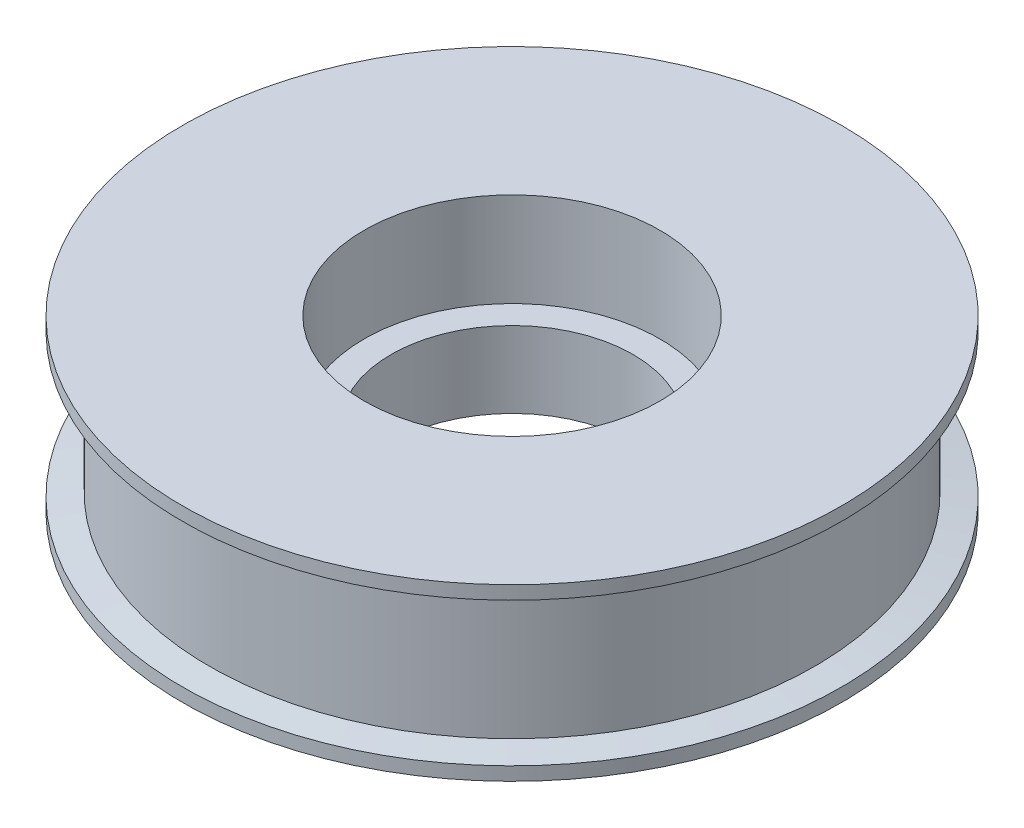
ISO-10303-21;
HEADER;
FILE_DESCRIPTION(('STEP AP214'),'2;1');
FILE_NAME('part.step','',(''),(''),'','','');
FILE_SCHEMA(('AUTOMOTIVE_DESIGN { 1 0 10303 214 1 1 1 1 }'));
ENDSEC;
DATA;
#1=APPLICATION_CONTEXT('core data for automotive mechanical design processes');
#2=APPLICATION_PROTOCOL_DEFINITION('international standard','automotive_design',2000,#1);
#3=PRODUCT_CONTEXT('',#1,'mechanical');
#4=PRODUCT('Part','Part','',(#3));
#5=PRODUCT_RELATED_PRODUCT_CATEGORY('part','',(#4));
#6=PRODUCT_DEFINITION_FORMATION('','',#4);
#7=PRODUCT_DEFINITION_CONTEXT('part definition',#1,'design');
#8=PRODUCT_DEFINITION('design','',#6,#7);
#9=PRODUCT_DEFINITION_SHAPE('','',#8);
#10=(LENGTH_UNIT() NAMED_UNIT(*) SI_UNIT(.MILLI.,.METRE.));
#11=(NAMED_UNIT(*) PLANE_ANGLE_UNIT() SI_UNIT($,.RADIAN.));
#12=(NAMED_UNIT(*) SI_UNIT($,.STERADIAN.) SOLID_ANGLE_UNIT());
#13=UNCERTAINTY_MEASURE_WITH_UNIT(LENGTH_MEASURE(1.E-05),#10,'distance_accuracy_value','');
#14=(GEOMETRIC_REPRESENTATION_CONTEXT(3) GLOBAL_UNCERTAINTY_ASSIGNED_CONTEXT((#13)) GLOBAL_UNIT_ASSIGNED_CONTEXT((#10,
#11,#12)) REPRESENTATION_CONTEXT('',''));
#15=CARTESIAN_POINT('',(0.,0.,0.));
#16=DIRECTION('',(0.,0.,1.));
#17=DIRECTION('',(1.,0.,0.));
#18=AXIS2_PLACEMENT_3D('',#15,#16,#17);
#19=CARTESIAN_POINT('',(0.,11.66,0.));
#20=DIRECTION('',(0.,1.,0.));
#21=DIRECTION('',(0.,0.,1.));
#22=AXIS2_PLACEMENT_3D('',#19,#20,#21);
#23=PLANE('',#22);
#24=CARTESIAN_POINT('',(0.,11.66,0.));
#25=DIRECTION('',(0.,1.,0.));
#26=DIRECTION('',(0.,0.,1.));
#27=AXIS2_PLACEMENT_3D('',#24,#25,#26);
#28=CIRCLE('',#27,11.);
#29=CARTESIAN_POINT('',(0.,11.66,11.));
#30=VERTEX_POINT('',#29);
#31=EDGE_CURVE('E40',#30,#30,#28,.T.);
#32=ORIENTED_EDGE('',*,*,#31,.F.);
#33=EDGE_LOOP('',(#32));
#34=FACE_BOUND('',#33,.T.);
#35=CARTESIAN_POINT('',(0.,11.66,0.));
#36=DIRECTION('',(0.,-1.,0.));
#37=DIRECTION('',(0.,0.,-1.));
#38=AXIS2_PLACEMENT_3D('',#35,#36,#37);
#39=CIRCLE('',#38,24.5);
#40=CARTESIAN_POINT('',(0.,11.66,-24.5));
#41=VERTEX_POINT('',#40);
#42=EDGE_CURVE('E53',#41,#41,#39,.T.);
#43=ORIENTED_EDGE('',*,*,#42,.F.);
#44=EDGE_LOOP('',(#43));
#45=FACE_BOUND('',#44,.T.);
#46=ADVANCED_FACE('F33',(#34,#45),#23,.T.);
#47=CARTESIAN_POINT('',(0.,11.66,0.));
#48=DIRECTION('',(0.,-1.,0.));
#49=DIRECTION('',(0.,0.,-1.));
#50=AXIS2_PLACEMENT_3D('',#47,#48,#49);
#51=CYLINDRICAL_SURFACE('',#50,22.5);
#52=CARTESIAN_POINT('',(0.,10.33,0.));
#53=DIRECTION('',(0.,-1.,0.));
#54=DIRECTION('',(0.,0.,-1.));
#55=AXIS2_PLACEMENT_3D('',#52,#53,#54);
#56=CIRCLE('',#55,22.5);
#57=CARTESIAN_POINT('',(0.,10.33,-22.5));
#58=VERTEX_POINT('',#57);
#59=EDGE_CURVE('E44',#58,#58,#56,.T.);
#60=ORIENTED_EDGE('',*,*,#59,.T.);
#61=EDGE_LOOP('',(#60));
#62=FACE_BOUND('',#61,.T.);
#63=CARTESIAN_POINT('',(0.,0.330000000000001,0.));
#64=DIRECTION('',(0.,-1.,0.));
#65=DIRECTION('',(0.,0.,-1.));
#66=AXIS2_PLACEMENT_3D('',#63,#64,#65);
#67=CIRCLE('',#66,22.5);
#68=CARTESIAN_POINT('',(0.,0.330000000000001,-22.5));
#69=VERTEX_POINT('',#68);
#70=EDGE_CURVE('E59',#69,#69,#67,.T.);
#71=ORIENTED_EDGE('',*,*,#70,.F.);
#72=EDGE_LOOP('',(#71));
#73=FACE_BOUND('',#72,.T.);
#74=ADVANCED_FACE('F35',(#62,#73),#51,.T.);
#75=CARTESIAN_POINT('',(0.,11.66,0.));
#76=DIRECTION('',(0.,-1.,0.));
#77=DIRECTION('',(0.,0.,-1.));
#78=AXIS2_PLACEMENT_3D('',#75,#76,#77);
#79=CYLINDRICAL_SURFACE('',#78,11.);
#80=CARTESIAN_POINT('',(0.,4.66,0.));
#81=DIRECTION('',(0.,1.,0.));
#82=DIRECTION('',(0.,0.,1.));
#83=AXIS2_PLACEMENT_3D('',#80,#81,#82);
#84=CIRCLE('',#83,11.);
#85=CARTESIAN_POINT('',(0.,4.66,11.));
#86=VERTEX_POINT('',#85);
#87=EDGE_CURVE('E10',#86,#86,#84,.T.);
#88=ORIENTED_EDGE('',*,*,#87,.F.);
#89=EDGE_LOOP('',(#88));
#90=FACE_BOUND('',#89,.T.);
#91=ORIENTED_EDGE('',*,*,#31,.T.);
#92=EDGE_LOOP('',(#91));
#93=FACE_BOUND('',#92,.T.);
#94=ADVANCED_FACE('F91',(#90,#93),#79,.F.);
#95=CARTESIAN_POINT('',(0.,10.33,0.));
#96=DIRECTION('',(0.,1.,0.));
#97=DIRECTION('',(0.,0.,1.));
#98=AXIS2_PLACEMENT_3D('',#95,#96,#97);
#99=CONICAL_SURFACE('',#98,22.5,1.4072697079739);
#100=CARTESIAN_POINT('',(0.,10.66,0.));
#101=DIRECTION('',(0.,-1.,0.));
#102=DIRECTION('',(0.,0.,-1.));
#103=AXIS2_PLACEMENT_3D('',#100,#101,#102);
#104=CIRCLE('',#103,24.5);
#105=CARTESIAN_POINT('',(0.,10.66,-24.5));
#106=VERTEX_POINT('',#105);
#107=EDGE_CURVE('E48',#106,#106,#104,.T.);
#108=ORIENTED_EDGE('',*,*,#107,.T.);
#109=EDGE_LOOP('',(#108));
#110=FACE_BOUND('',#109,.T.);
#111=ORIENTED_EDGE('',*,*,#59,.F.);
#112=EDGE_LOOP('',(#111));
#113=FACE_BOUND('',#112,.T.);
#114=ADVANCED_FACE('F97',(#110,#113),#99,.T.);
#115=CARTESIAN_POINT('',(0.,0.,0.));
#116=DIRECTION('',(0.,-1.,0.));
#117=DIRECTION('',(0.,0.,-1.));
#118=AXIS2_PLACEMENT_3D('',#115,#116,#117);
#119=CYLINDRICAL_SURFACE('',#118,24.5);
#120=ORIENTED_EDGE('',*,*,#42,.T.);
#121=EDGE_LOOP('',(#120));
#122=FACE_BOUND('',#121,.T.);
#123=ORIENTED_EDGE('',*,*,#107,.F.);
#124=EDGE_LOOP('',(#123));
#125=FACE_BOUND('',#124,.T.);
#126=ADVANCED_FACE('F101',(#122,#125),#119,.T.);
#127=CARTESIAN_POINT('',(22.5,4.66,0.));
#128=DIRECTION('',(0.,1.,0.));
#129=DIRECTION('',(0.,0.,1.));
#130=AXIS2_PLACEMENT_3D('',#127,#128,#129);
#131=PLANE('',#130);
#132=CARTESIAN_POINT('',(0.,4.66,0.));
#133=DIRECTION('',(0.,-1.,0.));
#134=DIRECTION('',(0.,0.,-1.));
#135=AXIS2_PLACEMENT_3D('',#132,#133,#134);
#136=CIRCLE('',#135,9.);
#137=CARTESIAN_POINT('',(0.,4.66,-9.));
#138=VERTEX_POINT('',#137);
#139=EDGE_CURVE('E56',#138,#138,#136,.T.);
#140=ORIENTED_EDGE('',*,*,#139,.T.);
#141=EDGE_LOOP('',(#140));
#142=FACE_BOUND('',#141,.T.);
#143=ORIENTED_EDGE('',*,*,#87,.T.);
#144=EDGE_LOOP('',(#143));
#145=FACE_BOUND('',#144,.T.);
#146=ADVANCED_FACE('F105',(#142,#145),#131,.T.);
#147=CARTESIAN_POINT('',(0.,0.,0.));
#148=DIRECTION('',(0.,-1.,0.));
#149=DIRECTION('',(0.,0.,-1.));
#150=AXIS2_PLACEMENT_3D('',#147,#148,#149);
#151=CYLINDRICAL_SURFACE('',#150,9.);
#152=CARTESIAN_POINT('',(0.,-0.999999999999999,0.));
#153=DIRECTION('',(0.,-1.,0.));
#154=DIRECTION('',(0.,0.,-1.));
#155=AXIS2_PLACEMENT_3D('',#152,#153,#154);
#156=CIRCLE('',#155,9.);
#157=CARTESIAN_POINT('',(0.,-0.999999999999999,-9.));
#158=VERTEX_POINT('',#157);
#159=EDGE_CURVE('E68',#158,#158,#156,.T.);
#160=ORIENTED_EDGE('',*,*,#159,.T.);
#161=EDGE_LOOP('',(#160));
#162=FACE_BOUND('',#161,.T.);
#163=ORIENTED_EDGE('',*,*,#139,.F.);
#164=EDGE_LOOP('',(#163));
#165=FACE_BOUND('',#164,.T.);
#166=ADVANCED_FACE('F72',(#162,#165),#151,.F.);
#167=CARTESIAN_POINT('',(0.,0.,0.));
#168=DIRECTION('',(0.,-1.,0.));
#169=DIRECTION('',(0.,0.,-1.));
#170=AXIS2_PLACEMENT_3D('',#167,#168,#169);
#171=CONICAL_SURFACE('',#170,24.5,1.4072697079739);
#172=ORIENTED_EDGE('',*,*,#70,.T.);
#173=EDGE_LOOP('',(#172));
#174=FACE_BOUND('',#173,.T.);
#175=CARTESIAN_POINT('',(0.,0.,0.));
#176=DIRECTION('',(0.,-1.,0.));
#177=DIRECTION('',(0.,0.,-1.));
#178=AXIS2_PLACEMENT_3D('',#175,#176,#177);
#179=CIRCLE('',#178,24.5);
#180=CARTESIAN_POINT('',(0.,0.,-24.5));
#181=VERTEX_POINT('',#180);
#182=EDGE_CURVE('E62',#181,#181,#179,.T.);
#183=ORIENTED_EDGE('',*,*,#182,.F.);
#184=EDGE_LOOP('',(#183));
#185=FACE_BOUND('',#184,.T.);
#186=ADVANCED_FACE('F83',(#174,#185),#171,.T.);
#187=CARTESIAN_POINT('',(0.,0.,0.));
#188=DIRECTION('',(0.,-1.,0.));
#189=DIRECTION('',(0.,0.,-1.));
#190=AXIS2_PLACEMENT_3D('',#187,#188,#189);
#191=CYLINDRICAL_SURFACE('',#190,24.5);
#192=ORIENTED_EDGE('',*,*,#182,.T.);
#193=EDGE_LOOP('',(#192));
#194=FACE_BOUND('',#193,.T.);
#195=CARTESIAN_POINT('',(0.,-0.999999999999999,0.));
#196=DIRECTION('',(0.,-1.,0.));
#197=DIRECTION('',(0.,0.,-1.));
#198=AXIS2_PLACEMENT_3D('',#195,#196,#197);
#199=CIRCLE('',#198,24.5);
#200=CARTESIAN_POINT('',(0.,-0.999999999999999,-24.5));
#201=VERTEX_POINT('',#200);
#202=EDGE_CURVE('E65',#201,#201,#199,.T.);
#203=ORIENTED_EDGE('',*,*,#202,.F.);
#204=EDGE_LOOP('',(#203));
#205=FACE_BOUND('',#204,.T.);
#206=ADVANCED_FACE('F77',(#194,#205),#191,.T.);
#207=CARTESIAN_POINT('',(22.5,-0.999999999999999,0.));
#208=DIRECTION('',(0.,-1.,0.));
#209=DIRECTION('',(0.,0.,-1.));
#210=AXIS2_PLACEMENT_3D('',#207,#208,#209);
#211=PLANE('',#210);
#212=ORIENTED_EDGE('',*,*,#202,.T.);
#213=EDGE_LOOP('',(#212));
#214=FACE_BOUND('',#213,.T.);
#215=ORIENTED_EDGE('',*,*,#159,.F.);
#216=EDGE_LOOP('',(#215));
#217=FACE_BOUND('',#216,.T.);
#218=ADVANCED_FACE('F75',(#214,#217),#211,.T.);
#219=CLOSED_SHELL('',(#46,#74,#94,#114,#126,#146,#166,#186,#206,#218));
#220=MANIFOLD_SOLID_BREP('B2',#219);
#221=ADVANCED_BREP_SHAPE_REPRESENTATION('',(#18,#220),#14);
#222=SHAPE_DEFINITION_REPRESENTATION(#9,#221);
ENDSEC;
END-ISO-10303-21;
